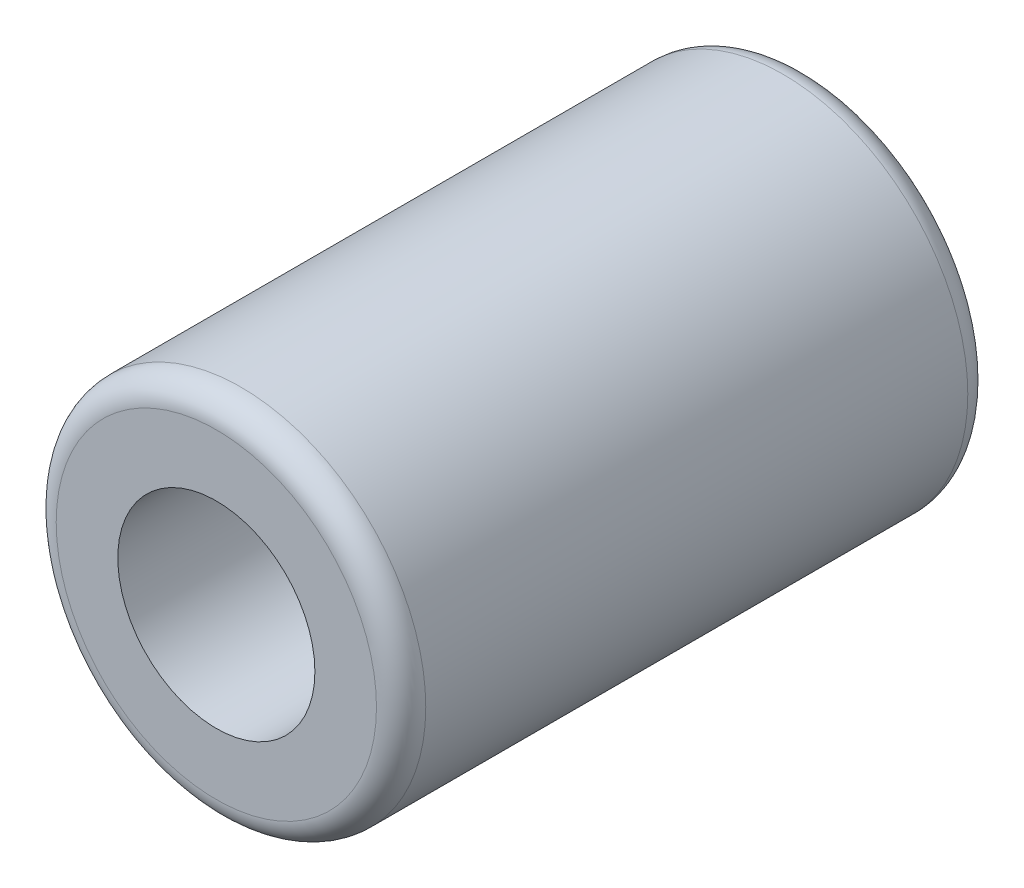
ISO-10303-21;
HEADER;
FILE_DESCRIPTION(('STEP AP214'),'2;1');
FILE_NAME('part.step','',(''),(''),'','','');
FILE_SCHEMA(('AUTOMOTIVE_DESIGN { 1 0 10303 214 1 1 1 1 }'));
ENDSEC;
DATA;
#1=APPLICATION_CONTEXT('core data for automotive mechanical design processes');
#2=APPLICATION_PROTOCOL_DEFINITION('international standard','automotive_design',2000,#1);
#3=PRODUCT_CONTEXT('',#1,'mechanical');
#4=PRODUCT('Part','Part','',(#3));
#5=PRODUCT_RELATED_PRODUCT_CATEGORY('part','',(#4));
#6=PRODUCT_DEFINITION_FORMATION('','',#4);
#7=PRODUCT_DEFINITION_CONTEXT('part definition',#1,'design');
#8=PRODUCT_DEFINITION('design','',#6,#7);
#9=PRODUCT_DEFINITION_SHAPE('','',#8);
#10=(LENGTH_UNIT() NAMED_UNIT(*) SI_UNIT(.MILLI.,.METRE.));
#11=(NAMED_UNIT(*) PLANE_ANGLE_UNIT() SI_UNIT($,.RADIAN.));
#12=(NAMED_UNIT(*) SI_UNIT($,.STERADIAN.) SOLID_ANGLE_UNIT());
#13=UNCERTAINTY_MEASURE_WITH_UNIT(LENGTH_MEASURE(1.E-05),#10,'distance_accuracy_value','');
#14=(GEOMETRIC_REPRESENTATION_CONTEXT(3) GLOBAL_UNCERTAINTY_ASSIGNED_CONTEXT((#13)) GLOBAL_UNIT_ASSIGNED_CONTEXT((#10,
#11,#12)) REPRESENTATION_CONTEXT('',''));
#15=CARTESIAN_POINT('',(0.,0.,0.));
#16=DIRECTION('',(0.,0.,1.));
#17=DIRECTION('',(1.,0.,0.));
#18=AXIS2_PLACEMENT_3D('',#15,#16,#17);
#19=CARTESIAN_POINT('',(0.,0.,24.));
#20=DIRECTION('',(0.,0.,1.));
#21=DIRECTION('',(1.,0.,0.));
#22=AXIS2_PLACEMENT_3D('',#19,#20,#21);
#23=PLANE('',#22);
#24=CARTESIAN_POINT('',(0.,0.,24.));
#25=DIRECTION('',(0.,0.,1.));
#26=DIRECTION('',(1.,0.,0.));
#27=AXIS2_PLACEMENT_3D('',#24,#25,#26);
#28=CIRCLE('',#27,6.5);
#29=CARTESIAN_POINT('',(6.5,0.,24.));
#30=VERTEX_POINT('',#29);
#31=EDGE_CURVE('E10',#30,#30,#28,.T.);
#32=ORIENTED_EDGE('',*,*,#31,.T.);
#33=EDGE_LOOP('',(#32));
#34=FACE_BOUND('',#33,.T.);
#35=CARTESIAN_POINT('',(0.,0.,24.));
#36=DIRECTION('',(0.,0.,1.));
#37=DIRECTION('',(1.,0.,0.));
#38=AXIS2_PLACEMENT_3D('',#35,#36,#37);
#39=CIRCLE('',#38,4.);
#40=CARTESIAN_POINT('',(4.,0.,24.));
#41=VERTEX_POINT('',#40);
#42=EDGE_CURVE('E51',#41,#41,#39,.T.);
#43=ORIENTED_EDGE('',*,*,#42,.F.);
#44=EDGE_LOOP('',(#43));
#45=FACE_BOUND('',#44,.T.);
#46=ADVANCED_FACE('F31',(#34,#45),#23,.T.);
#47=CARTESIAN_POINT('',(0.,0.,0.));
#48=DIRECTION('',(0.,0.,1.));
#49=DIRECTION('',(1.,0.,0.));
#50=AXIS2_PLACEMENT_3D('',#47,#48,#49);
#51=PLANE('',#50);
#52=CARTESIAN_POINT('',(0.,0.,0.));
#53=DIRECTION('',(0.,0.,1.));
#54=DIRECTION('',(1.,0.,0.));
#55=AXIS2_PLACEMENT_3D('',#52,#53,#54);
#56=CIRCLE('',#55,6.5);
#57=CARTESIAN_POINT('',(6.5,0.,0.));
#58=VERTEX_POINT('',#57);
#59=EDGE_CURVE('E38',#58,#58,#56,.F.);
#60=ORIENTED_EDGE('',*,*,#59,.T.);
#61=EDGE_LOOP('',(#60));
#62=FACE_BOUND('',#61,.T.);
#63=CARTESIAN_POINT('',(0.,0.,0.));
#64=DIRECTION('',(0.,0.,1.));
#65=DIRECTION('',(1.,0.,0.));
#66=AXIS2_PLACEMENT_3D('',#63,#64,#65);
#67=CIRCLE('',#66,4.);
#68=CARTESIAN_POINT('',(4.,0.,0.));
#69=VERTEX_POINT('',#68);
#70=EDGE_CURVE('E52',#69,#69,#67,.T.);
#71=ORIENTED_EDGE('',*,*,#70,.T.);
#72=EDGE_LOOP('',(#71));
#73=FACE_BOUND('',#72,.T.);
#74=ADVANCED_FACE('F62',(#62,#73),#51,.F.);
#75=CARTESIAN_POINT('',(0.,0.,24.));
#76=DIRECTION('',(0.,0.,-1.));
#77=DIRECTION('',(-1.,0.,0.));
#78=AXIS2_PLACEMENT_3D('',#75,#76,#77);
#79=CYLINDRICAL_SURFACE('',#78,7.5);
#80=CARTESIAN_POINT('',(0.,0.,1.));
#81=DIRECTION('',(0.,0.,1.));
#82=DIRECTION('',(1.,0.,0.));
#83=AXIS2_PLACEMENT_3D('',#80,#81,#82);
#84=CIRCLE('',#83,7.5);
#85=CARTESIAN_POINT('',(7.5,0.,1.));
#86=VERTEX_POINT('',#85);
#87=EDGE_CURVE('E42',#86,#86,#84,.T.);
#88=ORIENTED_EDGE('',*,*,#87,.T.);
#89=EDGE_LOOP('',(#88));
#90=FACE_BOUND('',#89,.T.);
#91=CARTESIAN_POINT('',(0.,0.,23.));
#92=DIRECTION('',(0.,0.,1.));
#93=DIRECTION('',(1.,0.,0.));
#94=AXIS2_PLACEMENT_3D('',#91,#92,#93);
#95=CIRCLE('',#94,7.5);
#96=CARTESIAN_POINT('',(7.5,0.,23.));
#97=VERTEX_POINT('',#96);
#98=EDGE_CURVE('E46',#97,#97,#95,.F.);
#99=ORIENTED_EDGE('',*,*,#98,.T.);
#100=EDGE_LOOP('',(#99));
#101=FACE_BOUND('',#100,.T.);
#102=ADVANCED_FACE('F67',(#90,#101),#79,.T.);
#103=CARTESIAN_POINT('',(0.,0.,24.));
#104=DIRECTION('',(0.,0.,-1.));
#105=DIRECTION('',(-1.,0.,0.));
#106=AXIS2_PLACEMENT_3D('',#103,#104,#105);
#107=CYLINDRICAL_SURFACE('',#106,4.);
#108=ORIENTED_EDGE('',*,*,#42,.T.);
#109=EDGE_LOOP('',(#108));
#110=FACE_BOUND('',#109,.T.);
#111=ORIENTED_EDGE('',*,*,#70,.F.);
#112=EDGE_LOOP('',(#111));
#113=FACE_BOUND('',#112,.T.);
#114=ADVANCED_FACE('F58',(#110,#113),#107,.F.);
#115=CARTESIAN_POINT('',(0.,0.,1.));
#116=DIRECTION('',(0.,0.,1.));
#117=DIRECTION('',(1.,0.,0.));
#118=AXIS2_PLACEMENT_3D('',#115,#116,#117);
#119=TOROIDAL_SURFACE('',#118,6.5,1.);
#120=ORIENTED_EDGE('',*,*,#59,.F.);
#121=EDGE_LOOP('',(#120));
#122=FACE_BOUND('',#121,.T.);
#123=ORIENTED_EDGE('',*,*,#87,.F.);
#124=EDGE_LOOP('',(#123));
#125=FACE_BOUND('',#124,.T.);
#126=ADVANCED_FACE('F73',(#122,#125),#119,.T.);
#127=CARTESIAN_POINT('',(0.,0.,23.));
#128=DIRECTION('',(0.,0.,1.));
#129=DIRECTION('',(1.,0.,0.));
#130=AXIS2_PLACEMENT_3D('',#127,#128,#129);
#131=TOROIDAL_SURFACE('',#130,6.5,1.);
#132=ORIENTED_EDGE('',*,*,#98,.F.);
#133=EDGE_LOOP('',(#132));
#134=FACE_BOUND('',#133,.T.);
#135=ORIENTED_EDGE('',*,*,#31,.F.);
#136=EDGE_LOOP('',(#135));
#137=FACE_BOUND('',#136,.T.);
#138=ADVANCED_FACE('F33',(#134,#137),#131,.T.);
#139=CLOSED_SHELL('',(#46,#74,#102,#114,#126,#138));
#140=MANIFOLD_SOLID_BREP('B2',#139);
#141=ADVANCED_BREP_SHAPE_REPRESENTATION('',(#18,#140),#14);
#142=SHAPE_DEFINITION_REPRESENTATION(#9,#141);
ENDSEC;
END-ISO-10303-21;
